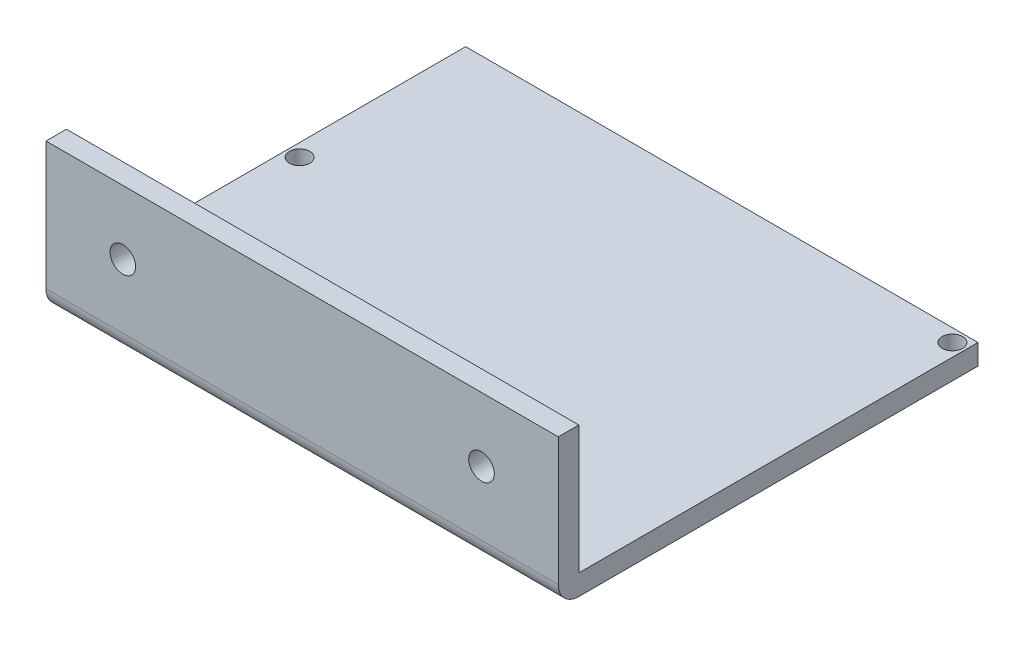
ISO-10303-21;
HEADER;
FILE_DESCRIPTION(('STEP AP214'),'2;1');
FILE_NAME('part.step','',(''),(''),'','','');
FILE_SCHEMA(('AUTOMOTIVE_DESIGN { 1 0 10303 214 1 1 1 1 }'));
ENDSEC;
DATA;
#1=APPLICATION_CONTEXT('core data for automotive mechanical design processes');
#2=APPLICATION_PROTOCOL_DEFINITION('international standard','automotive_design',2000,#1);
#3=PRODUCT_CONTEXT('',#1,'mechanical');
#4=PRODUCT('Part','Part','',(#3));
#5=PRODUCT_RELATED_PRODUCT_CATEGORY('part','',(#4));
#6=PRODUCT_DEFINITION_FORMATION('','',#4);
#7=PRODUCT_DEFINITION_CONTEXT('part definition',#1,'design');
#8=PRODUCT_DEFINITION('design','',#6,#7);
#9=PRODUCT_DEFINITION_SHAPE('','',#8);
#10=(LENGTH_UNIT() NAMED_UNIT(*) SI_UNIT(.MILLI.,.METRE.));
#11=(NAMED_UNIT(*) PLANE_ANGLE_UNIT() SI_UNIT($,.RADIAN.));
#12=(NAMED_UNIT(*) SI_UNIT($,.STERADIAN.) SOLID_ANGLE_UNIT());
#13=UNCERTAINTY_MEASURE_WITH_UNIT(LENGTH_MEASURE(1.E-05),#10,'distance_accuracy_value','');
#14=(GEOMETRIC_REPRESENTATION_CONTEXT(3) GLOBAL_UNCERTAINTY_ASSIGNED_CONTEXT((#13)) GLOBAL_UNIT_ASSIGNED_CONTEXT((#10,
#11,#12)) REPRESENTATION_CONTEXT('',''));
#15=CARTESIAN_POINT('',(0.,0.,0.));
#16=DIRECTION('',(0.,0.,1.));
#17=DIRECTION('',(1.,0.,0.));
#18=AXIS2_PLACEMENT_3D('',#15,#16,#17);
#19=CARTESIAN_POINT('',(100.,4.,0.));
#20=DIRECTION('',(1.,0.,0.));
#21=DIRECTION('',(0.,0.,-1.));
#22=AXIS2_PLACEMENT_3D('',#19,#20,#21);
#23=PLANE('',#22);
#24=DIRECTION('',(0.,0.,1.));
#25=VECTOR('',#24,1.);
#26=CARTESIAN_POINT('',(100.,0.,0.));
#27=LINE('',#26,#25);
#28=CARTESIAN_POINT('',(100.,0.,-72.9078086307585));
#29=VERTEX_POINT('',#28);
#30=CARTESIAN_POINT('',(100.,0.,5.));
#31=VERTEX_POINT('',#30);
#32=EDGE_CURVE('E474',#29,#31,#27,.T.);
#33=ORIENTED_EDGE('',*,*,#32,.F.);
#34=DIRECTION('',(0.,-1.,0.));
#35=VECTOR('',#34,1.);
#36=CARTESIAN_POINT('',(100.,4.,-72.9078086307585));
#37=LINE('',#36,#35);
#38=CARTESIAN_POINT('',(100.,4.,-72.9078086307585));
#39=VERTEX_POINT('',#38);
#40=EDGE_CURVE('E11',#39,#29,#37,.T.);
#41=ORIENTED_EDGE('',*,*,#40,.F.);
#42=DIRECTION('',(0.,0.,1.));
#43=VECTOR('',#42,1.);
#44=CARTESIAN_POINT('',(100.,4.,0.));
#45=LINE('',#44,#43);
#46=CARTESIAN_POINT('',(100.,4.,5.));
#47=VERTEX_POINT('',#46);
#48=EDGE_CURVE('E455',#39,#47,#45,.T.);
#49=ORIENTED_EDGE('',*,*,#48,.T.);
#50=DIRECTION('',(0.,-1.,0.));
#51=VECTOR('',#50,1.);
#52=CARTESIAN_POINT('',(100.,4.,5.));
#53=LINE('',#52,#51);
#54=CARTESIAN_POINT('',(100.,29.,5.));
#55=VERTEX_POINT('',#54);
#56=EDGE_CURVE('E418',#55,#47,#53,.T.);
#57=ORIENTED_EDGE('',*,*,#56,.F.);
#58=DIRECTION('',(0.,0.,-1.));
#59=VECTOR('',#58,1.);
#60=CARTESIAN_POINT('',(100.,29.,5.00000000000001));
#61=LINE('',#60,#59);
#62=CARTESIAN_POINT('',(100.,29.,9.));
#63=VERTEX_POINT('',#62);
#64=EDGE_CURVE('E423',#63,#55,#61,.T.);
#65=ORIENTED_EDGE('',*,*,#64,.F.);
#66=DIRECTION('',(0.,1.,0.));
#67=VECTOR('',#66,1.);
#68=CARTESIAN_POINT('',(100.,29.,9.));
#69=LINE('',#68,#67);
#70=CARTESIAN_POINT('',(100.,4.,9.00000000000001));
#71=VERTEX_POINT('',#70);
#72=EDGE_CURVE('E427',#71,#63,#69,.T.);
#73=ORIENTED_EDGE('',*,*,#72,.F.);
#74=CARTESIAN_POINT('',(100.,4.,5.));
#75=DIRECTION('',(1.,0.,0.));
#76=DIRECTION('',(0.,0.,-1.));
#77=AXIS2_PLACEMENT_3D('',#74,#75,#76);
#78=CIRCLE('',#77,4.);
#79=EDGE_CURVE('E431',#31,#71,#78,.F.);
#80=ORIENTED_EDGE('',*,*,#79,.F.);
#81=EDGE_LOOP('',(#33,#41,#49,#57,#65,#73,#80));
#82=FACE_BOUND('',#81,.T.);
#83=ADVANCED_FACE('F37',(#82),#23,.T.);
#84=CARTESIAN_POINT('',(0.,4.,-72.9078086307585));
#85=DIRECTION('',(0.,0.,-1.));
#86=DIRECTION('',(-1.,0.,0.));
#87=AXIS2_PLACEMENT_3D('',#84,#85,#86);
#88=PLANE('',#87);
#89=DIRECTION('',(1.,0.,0.));
#90=VECTOR('',#89,1.);
#91=CARTESIAN_POINT('',(0.,0.,-72.9078086307585));
#92=LINE('',#91,#90);
#93=CARTESIAN_POINT('',(0.,0.,-72.9078086307585));
#94=VERTEX_POINT('',#93);
#95=EDGE_CURVE('E476',#94,#29,#92,.T.);
#96=ORIENTED_EDGE('',*,*,#95,.F.);
#97=DIRECTION('',(0.,-1.,0.));
#98=VECTOR('',#97,1.);
#99=CARTESIAN_POINT('',(0.,4.,-72.9078086307585));
#100=LINE('',#99,#98);
#101=CARTESIAN_POINT('',(0.,4.,-72.9078086307585));
#102=VERTEX_POINT('',#101);
#103=EDGE_CURVE('E45',#102,#94,#100,.T.);
#104=ORIENTED_EDGE('',*,*,#103,.F.);
#105=DIRECTION('',(1.,0.,0.));
#106=VECTOR('',#105,1.);
#107=CARTESIAN_POINT('',(0.,4.,-72.9078086307585));
#108=LINE('',#107,#106);
#109=EDGE_CURVE('E457',#102,#39,#108,.T.);
#110=ORIENTED_EDGE('',*,*,#109,.T.);
#111=ORIENTED_EDGE('',*,*,#40,.T.);
#112=EDGE_LOOP('',(#96,#104,#110,#111));
#113=FACE_BOUND('',#112,.T.);
#114=ADVANCED_FACE('F485',(#113),#88,.T.);
#115=CARTESIAN_POINT('',(20.,4.,-3.49999999999999));
#116=DIRECTION('',(0.,-1.,0.));
#117=DIRECTION('',(0.,0.,-1.));
#118=AXIS2_PLACEMENT_3D('',#115,#116,#117);
#119=CYLINDRICAL_SURFACE('',#118,2.0830802465931);
#120=CARTESIAN_POINT('',(20.,4.,-3.49999999999999));
#121=DIRECTION('',(0.,1.,0.));
#122=DIRECTION('',(0.,0.,1.));
#123=AXIS2_PLACEMENT_3D('',#120,#121,#122);
#124=CIRCLE('',#123,2.0830802465931);
#125=CARTESIAN_POINT('',(20.,4.,-1.41691975340689));
#126=VERTEX_POINT('',#125);
#127=EDGE_CURVE('E452',#126,#126,#124,.T.);
#128=ORIENTED_EDGE('',*,*,#127,.T.);
#129=EDGE_LOOP('',(#128));
#130=FACE_BOUND('',#129,.T.);
#131=CARTESIAN_POINT('',(20.,0.,-3.49999999999999));
#132=DIRECTION('',(0.,1.,0.));
#133=DIRECTION('',(0.,0.,1.));
#134=AXIS2_PLACEMENT_3D('',#131,#132,#133);
#135=CIRCLE('',#134,2.0830802465931);
#136=CARTESIAN_POINT('',(20.,0.,-1.41691975340689));
#137=VERTEX_POINT('',#136);
#138=EDGE_CURVE('E471',#137,#137,#135,.T.);
#139=ORIENTED_EDGE('',*,*,#138,.F.);
#140=EDGE_LOOP('',(#139));
#141=FACE_BOUND('',#140,.T.);
#142=ADVANCED_FACE('F516',(#130,#141),#119,.F.);
#143=CARTESIAN_POINT('',(82.5,4.,-3.5));
#144=DIRECTION('',(0.,-1.,0.));
#145=DIRECTION('',(0.,0.,-1.));
#146=AXIS2_PLACEMENT_3D('',#143,#144,#145);
#147=CYLINDRICAL_SURFACE('',#146,2.);
#148=CARTESIAN_POINT('',(82.5,4.,-3.5));
#149=DIRECTION('',(0.,1.,0.));
#150=DIRECTION('',(0.,0.,1.));
#151=AXIS2_PLACEMENT_3D('',#148,#149,#150);
#152=CIRCLE('',#151,2.);
#153=CARTESIAN_POINT('',(82.5,4.,-1.5));
#154=VERTEX_POINT('',#153);
#155=EDGE_CURVE('E449',#154,#154,#152,.T.);
#156=ORIENTED_EDGE('',*,*,#155,.T.);
#157=EDGE_LOOP('',(#156));
#158=FACE_BOUND('',#157,.T.);
#159=CARTESIAN_POINT('',(82.5,0.,-3.5));
#160=DIRECTION('',(0.,1.,0.));
#161=DIRECTION('',(0.,0.,1.));
#162=AXIS2_PLACEMENT_3D('',#159,#160,#161);
#163=CIRCLE('',#162,2.);
#164=CARTESIAN_POINT('',(82.5,0.,-1.5));
#165=VERTEX_POINT('',#164);
#166=EDGE_CURVE('E468',#165,#165,#163,.T.);
#167=ORIENTED_EDGE('',*,*,#166,.F.);
#168=EDGE_LOOP('',(#167));
#169=FACE_BOUND('',#168,.T.);
#170=ADVANCED_FACE('F522',(#158,#169),#147,.F.);
#171=CARTESIAN_POINT('',(2.5,4.,-38.));
#172=DIRECTION('',(0.,-1.,0.));
#173=DIRECTION('',(0.,0.,-1.));
#174=AXIS2_PLACEMENT_3D('',#171,#172,#173);
#175=CYLINDRICAL_SURFACE('',#174,2.);
#176=CARTESIAN_POINT('',(2.5,4.,-38.));
#177=DIRECTION('',(0.,1.,0.));
#178=DIRECTION('',(0.,0.,1.));
#179=AXIS2_PLACEMENT_3D('',#176,#177,#178);
#180=CIRCLE('',#179,2.);
#181=CARTESIAN_POINT('',(2.5,4.,-36.));
#182=VERTEX_POINT('',#181);
#183=EDGE_CURVE('E445',#182,#182,#180,.T.);
#184=ORIENTED_EDGE('',*,*,#183,.T.);
#185=EDGE_LOOP('',(#184));
#186=FACE_BOUND('',#185,.T.);
#187=CARTESIAN_POINT('',(2.5,0.,-38.));
#188=DIRECTION('',(0.,1.,0.));
#189=DIRECTION('',(0.,0.,1.));
#190=AXIS2_PLACEMENT_3D('',#187,#188,#189);
#191=CIRCLE('',#190,2.);
#192=CARTESIAN_POINT('',(2.5,0.,-36.));
#193=VERTEX_POINT('',#192);
#194=EDGE_CURVE('E465',#193,#193,#191,.T.);
#195=ORIENTED_EDGE('',*,*,#194,.F.);
#196=EDGE_LOOP('',(#195));
#197=FACE_BOUND('',#196,.T.);
#198=ADVANCED_FACE('F525',(#186,#197),#175,.F.);
#199=CARTESIAN_POINT('',(97.5,4.,-70.4078086307585));
#200=DIRECTION('',(0.,-1.,0.));
#201=DIRECTION('',(0.,0.,-1.));
#202=AXIS2_PLACEMENT_3D('',#199,#200,#201);
#203=CYLINDRICAL_SURFACE('',#202,2.);
#204=CARTESIAN_POINT('',(97.5,4.,-70.4078086307585));
#205=DIRECTION('',(0.,1.,0.));
#206=DIRECTION('',(0.,0.,1.));
#207=AXIS2_PLACEMENT_3D('',#204,#205,#206);
#208=CIRCLE('',#207,2.);
#209=CARTESIAN_POINT('',(97.5,4.,-68.4078086307585));
#210=VERTEX_POINT('',#209);
#211=EDGE_CURVE('E442',#210,#210,#208,.T.);
#212=ORIENTED_EDGE('',*,*,#211,.T.);
#213=EDGE_LOOP('',(#212));
#214=FACE_BOUND('',#213,.T.);
#215=CARTESIAN_POINT('',(97.5,0.,-70.4078086307585));
#216=DIRECTION('',(0.,1.,0.));
#217=DIRECTION('',(0.,0.,1.));
#218=AXIS2_PLACEMENT_3D('',#215,#216,#217);
#219=CIRCLE('',#218,2.);
#220=CARTESIAN_POINT('',(97.5,0.,-68.4078086307585));
#221=VERTEX_POINT('',#220);
#222=EDGE_CURVE('E436',#221,#221,#219,.T.);
#223=ORIENTED_EDGE('',*,*,#222,.F.);
#224=EDGE_LOOP('',(#223));
#225=FACE_BOUND('',#224,.T.);
#226=ADVANCED_FACE('F39',(#214,#225),#203,.F.);
#227=CARTESIAN_POINT('',(0.,4.,0.));
#228=DIRECTION('',(-1.,0.,0.));
#229=DIRECTION('',(0.,0.,1.));
#230=AXIS2_PLACEMENT_3D('',#227,#228,#229);
#231=PLANE('',#230);
#232=DIRECTION('',(0.,0.,-1.));
#233=VECTOR('',#232,1.);
#234=CARTESIAN_POINT('',(0.,0.,0.));
#235=LINE('',#234,#233);
#236=CARTESIAN_POINT('',(0.,0.,5.));
#237=VERTEX_POINT('',#236);
#238=EDGE_CURVE('E446',#237,#94,#235,.T.);
#239=ORIENTED_EDGE('',*,*,#238,.F.);
#240=CARTESIAN_POINT('',(0.,4.,5.));
#241=DIRECTION('',(-1.,0.,0.));
#242=DIRECTION('',(0.,0.,-1.));
#243=AXIS2_PLACEMENT_3D('',#240,#241,#242);
#244=CIRCLE('',#243,4.);
#245=CARTESIAN_POINT('',(0.,4.,9.00000000000001));
#246=VERTEX_POINT('',#245);
#247=EDGE_CURVE('E397',#237,#246,#244,.T.);
#248=ORIENTED_EDGE('',*,*,#247,.T.);
#249=DIRECTION('',(0.,1.,0.));
#250=VECTOR('',#249,1.);
#251=CARTESIAN_POINT('',(0.,29.,9.));
#252=LINE('',#251,#250);
#253=CARTESIAN_POINT('',(0.,29.,9.));
#254=VERTEX_POINT('',#253);
#255=EDGE_CURVE('E413',#246,#254,#252,.T.);
#256=ORIENTED_EDGE('',*,*,#255,.T.);
#257=DIRECTION('',(0.,0.,-1.));
#258=VECTOR('',#257,1.);
#259=CARTESIAN_POINT('',(0.,29.,5.));
#260=LINE('',#259,#258);
#261=CARTESIAN_POINT('',(0.,29.,5.));
#262=VERTEX_POINT('',#261);
#263=EDGE_CURVE('E410',#254,#262,#260,.T.);
#264=ORIENTED_EDGE('',*,*,#263,.T.);
#265=DIRECTION('',(0.,-1.,0.));
#266=VECTOR('',#265,1.);
#267=CARTESIAN_POINT('',(0.,4.,5.));
#268=LINE('',#267,#266);
#269=CARTESIAN_POINT('',(0.,4.,5.));
#270=VERTEX_POINT('',#269);
#271=EDGE_CURVE('E406',#262,#270,#268,.T.);
#272=ORIENTED_EDGE('',*,*,#271,.T.);
#273=DIRECTION('',(0.,0.,-1.));
#274=VECTOR('',#273,1.);
#275=CARTESIAN_POINT('',(0.,4.,0.));
#276=LINE('',#275,#274);
#277=EDGE_CURVE('E460',#270,#102,#276,.T.);
#278=ORIENTED_EDGE('',*,*,#277,.T.);
#279=ORIENTED_EDGE('',*,*,#103,.T.);
#280=EDGE_LOOP('',(#239,#248,#256,#264,#272,#278,#279));
#281=FACE_BOUND('',#280,.T.);
#282=ADVANCED_FACE('F482',(#281),#231,.T.);
#283=CARTESIAN_POINT('',(0.,4.,0.));
#284=DIRECTION('',(0.,1.,0.));
#285=DIRECTION('',(0.,0.,1.));
#286=AXIS2_PLACEMENT_3D('',#283,#284,#285);
#287=PLANE('',#286);
#288=ORIENTED_EDGE('',*,*,#211,.F.);
#289=EDGE_LOOP('',(#288));
#290=FACE_BOUND('',#289,.T.);
#291=ORIENTED_EDGE('',*,*,#183,.F.);
#292=EDGE_LOOP('',(#291));
#293=FACE_BOUND('',#292,.T.);
#294=ORIENTED_EDGE('',*,*,#155,.F.);
#295=EDGE_LOOP('',(#294));
#296=FACE_BOUND('',#295,.T.);
#297=ORIENTED_EDGE('',*,*,#127,.F.);
#298=EDGE_LOOP('',(#297));
#299=FACE_BOUND('',#298,.T.);
#300=ORIENTED_EDGE('',*,*,#277,.F.);
#301=DIRECTION('',(-1.,0.,0.));
#302=VECTOR('',#301,1.);
#303=CARTESIAN_POINT('',(130.364452901378,4.,5.));
#304=LINE('',#303,#302);
#305=EDGE_CURVE('E421',#47,#270,#304,.T.);
#306=ORIENTED_EDGE('',*,*,#305,.F.);
#307=ORIENTED_EDGE('',*,*,#48,.F.);
#308=ORIENTED_EDGE('',*,*,#109,.F.);
#309=EDGE_LOOP('',(#300,#306,#307,#308));
#310=FACE_BOUND('',#309,.T.);
#311=ADVANCED_FACE('F509',(#290,#293,#296,#299,#310),#287,.T.);
#312=CARTESIAN_POINT('',(0.,0.,0.));
#313=DIRECTION('',(0.,1.,0.));
#314=DIRECTION('',(0.,0.,1.));
#315=AXIS2_PLACEMENT_3D('',#312,#313,#314);
#316=PLANE('',#315);
#317=DIRECTION('',(0.,0.,1.));
#318=VECTOR('',#317,1.);
#319=CARTESIAN_POINT('',(97.8928279472022,0.,-63.6310799164491));
#320=LINE('',#319,#318);
#321=CARTESIAN_POINT('',(97.8928279472022,0.,-63.6310799164491));
#322=VERTEX_POINT('',#321);
#323=CARTESIAN_POINT('',(97.8928279472022,0.,-36.4151652990593));
#324=VERTEX_POINT('',#323);
#325=EDGE_CURVE('E277',#322,#324,#320,.T.);
#326=ORIENTED_EDGE('',*,*,#325,.F.);
#327=DIRECTION('',(0.674066970811212,0.,0.73867023688612));
#328=VECTOR('',#327,1.);
#329=CARTESIAN_POINT('',(91.252513721809,0.,-70.9078086307585));
#330=LINE('',#329,#328);
#331=CARTESIAN_POINT('',(91.252513721809,0.,-70.9078086307585));
#332=VERTEX_POINT('',#331);
#333=EDGE_CURVE('E52',#332,#322,#330,.T.);
#334=ORIENTED_EDGE('',*,*,#333,.F.);
#335=DIRECTION('',(1.,0.,0.));
#336=VECTOR('',#335,1.);
#337=CARTESIAN_POINT('',(91.252513721809,0.,-70.9078086307585));
#338=LINE('',#337,#336);
#339=CARTESIAN_POINT('',(3.43298061088859,0.,-70.9078086307585));
#340=VERTEX_POINT('',#339);
#341=EDGE_CURVE('E242',#340,#332,#338,.T.);
#342=ORIENTED_EDGE('',*,*,#341,.F.);
#343=DIRECTION('',(0.,0.,-1.));
#344=VECTOR('',#343,1.);
#345=CARTESIAN_POINT('',(3.43298061088859,0.,-70.9078086307585));
#346=LINE('',#345,#344);
#347=CARTESIAN_POINT('',(3.43298061088859,0.,-44.280868197459));
#348=VERTEX_POINT('',#347);
#349=EDGE_CURVE('E245',#348,#340,#346,.T.);
#350=ORIENTED_EDGE('',*,*,#349,.F.);
#351=DIRECTION('',(-1.,0.,0.));
#352=VECTOR('',#351,1.);
#353=CARTESIAN_POINT('',(12.6476428594877,0.,-44.280868197459));
#354=LINE('',#353,#352);
#355=CARTESIAN_POINT('',(12.6476428594877,0.,-44.280868197459));
#356=VERTEX_POINT('',#355);
#357=EDGE_CURVE('E304',#356,#348,#354,.T.);
#358=ORIENTED_EDGE('',*,*,#357,.F.);
#359=DIRECTION('',(0.,0.,1.));
#360=VECTOR('',#359,1.);
#361=CARTESIAN_POINT('',(12.6476428594877,0.,-63.6310799164491));
#362=LINE('',#361,#360);
#363=CARTESIAN_POINT('',(12.6476428594877,0.,-63.6310799164491));
#364=VERTEX_POINT('',#363);
#365=EDGE_CURVE('E301',#364,#356,#362,.T.);
#366=ORIENTED_EDGE('',*,*,#365,.F.);
#367=DIRECTION('',(-1.,0.,0.));
#368=VECTOR('',#367,1.);
#369=CARTESIAN_POINT('',(51.9500782906483,0.,-63.6310799164491));
#370=LINE('',#369,#368);
#371=CARTESIAN_POINT('',(51.9500782906483,0.,-63.6310799164491));
#372=VERTEX_POINT('',#371);
#373=EDGE_CURVE('E298',#372,#364,#370,.T.);
#374=ORIENTED_EDGE('',*,*,#373,.F.);
#375=DIRECTION('',(0.,0.,-1.));
#376=VECTOR('',#375,1.);
#377=CARTESIAN_POINT('',(51.9500782906483,0.,-63.6310799164491));
#378=LINE('',#377,#376);
#379=CARTESIAN_POINT('',(51.9500782906483,0.,-54.7474775195852));
#380=VERTEX_POINT('',#379);
#381=EDGE_CURVE('E295',#380,#372,#378,.T.);
#382=ORIENTED_EDGE('',*,*,#381,.F.);
#383=DIRECTION('',(-1.,0.,0.));
#384=VECTOR('',#383,1.);
#385=CARTESIAN_POINT('',(61.9788193724453,0.,-54.7474775195852));
#386=LINE('',#385,#384);
#387=CARTESIAN_POINT('',(61.9788193724453,0.,-54.7474775195852));
#388=VERTEX_POINT('',#387);
#389=EDGE_CURVE('E292',#388,#380,#386,.T.);
#390=ORIENTED_EDGE('',*,*,#389,.F.);
#391=DIRECTION('',(0.,0.,1.));
#392=VECTOR('',#391,1.);
#393=CARTESIAN_POINT('',(61.9788193724453,0.,-63.6310799164491));
#394=LINE('',#393,#392);
#395=CARTESIAN_POINT('',(61.9788193724453,0.,-63.6310799164491));
#396=VERTEX_POINT('',#395);
#397=EDGE_CURVE('E289',#396,#388,#394,.T.);
#398=ORIENTED_EDGE('',*,*,#397,.F.);
#399=DIRECTION('',(-1.,0.,0.));
#400=VECTOR('',#399,1.);
#401=CARTESIAN_POINT('',(91.252513721809,0.,-63.6310799164491));
#402=LINE('',#401,#400);
#403=CARTESIAN_POINT('',(91.252513721809,0.,-63.6310799164491));
#404=VERTEX_POINT('',#403);
#405=EDGE_CURVE('E286',#404,#396,#402,.T.);
#406=ORIENTED_EDGE('',*,*,#405,.F.);
#407=DIRECTION('',(0.,0.,-1.));
#408=VECTOR('',#407,1.);
#409=CARTESIAN_POINT('',(91.252513721809,0.,-63.6310799164491));
#410=LINE('',#409,#408);
#411=CARTESIAN_POINT('',(91.252513721809,0.,-36.4151652990593));
#412=VERTEX_POINT('',#411);
#413=EDGE_CURVE('E283',#412,#404,#410,.T.);
#414=ORIENTED_EDGE('',*,*,#413,.F.);
#415=DIRECTION('',(-1.,0.,0.));
#416=VECTOR('',#415,1.);
#417=CARTESIAN_POINT('',(91.252513721809,0.,-36.4151652990593));
#418=LINE('',#417,#416);
#419=EDGE_CURVE('E280',#324,#412,#418,.T.);
#420=ORIENTED_EDGE('',*,*,#419,.F.);
#421=EDGE_LOOP('',(#326,#334,#342,#350,#358,#366,#374,#382,#390,#398,#406,#414,#420));
#422=FACE_BOUND('',#421,.T.);
#423=DIRECTION('',(-1.,0.,0.));
#424=VECTOR('',#423,1.);
#425=CARTESIAN_POINT('',(78.4581876947499,0.,-1.4214969099271));
#426=LINE('',#425,#424);
#427=CARTESIAN_POINT('',(78.4581876947499,0.,-1.4214969099271));
#428=VERTEX_POINT('',#427);
#429=CARTESIAN_POINT('',(24.4257004078356,0.,-1.4214969099271));
#430=VERTEX_POINT('',#429);
#431=EDGE_CURVE('E348',#428,#430,#426,.T.);
#432=ORIENTED_EDGE('',*,*,#431,.F.);
#433=DIRECTION('',(0.,0.,1.));
#434=VECTOR('',#433,1.);
#435=CARTESIAN_POINT('',(78.4581876947499,0.,-5.65979680150974));
#436=LINE('',#435,#434);
#437=CARTESIAN_POINT('',(78.4581876947499,0.,-5.65979680150974));
#438=VERTEX_POINT('',#437);
#439=EDGE_CURVE('E60',#438,#428,#436,.T.);
#440=ORIENTED_EDGE('',*,*,#439,.F.);
#441=DIRECTION('',(1.,0.,0.));
#442=VECTOR('',#441,1.);
#443=CARTESIAN_POINT('',(78.4581876947499,0.,-5.65979680150974));
#444=LINE('',#443,#442);
#445=CARTESIAN_POINT('',(24.4257004078356,0.,-5.65979680150974));
#446=VERTEX_POINT('',#445);
#447=EDGE_CURVE('E337',#446,#438,#444,.T.);
#448=ORIENTED_EDGE('',*,*,#447,.F.);
#449=DIRECTION('',(0.,0.,-1.));
#450=VECTOR('',#449,1.);
#451=CARTESIAN_POINT('',(24.4257004078356,0.,-5.65979680150974));
#452=LINE('',#451,#450);
#453=EDGE_CURVE('E352',#430,#446,#452,.T.);
#454=ORIENTED_EDGE('',*,*,#453,.F.);
#455=EDGE_LOOP('',(#432,#440,#448,#454));
#456=FACE_BOUND('',#455,.T.);
#457=DIRECTION('',(-1.,0.,0.));
#458=VECTOR('',#457,1.);
#459=CARTESIAN_POINT('',(16.3357743673984,0.,-1.4214969099271));
#460=LINE('',#459,#458);
#461=CARTESIAN_POINT('',(16.3357743673984,0.,-1.4214969099271));
#462=VERTEX_POINT('',#461);
#463=CARTESIAN_POINT('',(3.43298061088859,0.,-1.4214969099271));
#464=VERTEX_POINT('',#463);
#465=EDGE_CURVE('E379',#462,#464,#460,.T.);
#466=ORIENTED_EDGE('',*,*,#465,.F.);
#467=DIRECTION('',(0.,0.,1.));
#468=VECTOR('',#467,1.);
#469=CARTESIAN_POINT('',(16.3357743673984,0.,-5.65979680150974));
#470=LINE('',#469,#468);
#471=CARTESIAN_POINT('',(16.3357743673984,0.,-5.65979680150974));
#472=VERTEX_POINT('',#471);
#473=EDGE_CURVE('E377',#472,#462,#470,.T.);
#474=ORIENTED_EDGE('',*,*,#473,.F.);
#475=DIRECTION('',(1.,0.,0.));
#476=VECTOR('',#475,1.);
#477=CARTESIAN_POINT('',(16.3357743673984,0.,-5.65979680150974));
#478=LINE('',#477,#476);
#479=CARTESIAN_POINT('',(3.43298061088859,0.,-5.65979680150974));
#480=VERTEX_POINT('',#479);
#481=EDGE_CURVE('E367',#480,#472,#478,.T.);
#482=ORIENTED_EDGE('',*,*,#481,.F.);
#483=DIRECTION('',(0.,0.,-1.));
#484=VECTOR('',#483,1.);
#485=CARTESIAN_POINT('',(3.43298061088859,0.,-5.65979680150974));
#486=LINE('',#485,#484);
#487=EDGE_CURVE('E382',#464,#480,#486,.T.);
#488=ORIENTED_EDGE('',*,*,#487,.F.);
#489=EDGE_LOOP('',(#466,#474,#482,#488));
#490=FACE_BOUND('',#489,.T.);
#491=ORIENTED_EDGE('',*,*,#222,.T.);
#492=EDGE_LOOP('',(#491));
#493=FACE_BOUND('',#492,.T.);
#494=ORIENTED_EDGE('',*,*,#194,.T.);
#495=EDGE_LOOP('',(#494));
#496=FACE_BOUND('',#495,.T.);
#497=ORIENTED_EDGE('',*,*,#166,.T.);
#498=EDGE_LOOP('',(#497));
#499=FACE_BOUND('',#498,.T.);
#500=ORIENTED_EDGE('',*,*,#138,.T.);
#501=EDGE_LOOP('',(#500));
#502=FACE_BOUND('',#501,.T.);
#503=ORIENTED_EDGE('',*,*,#32,.T.);
#504=DIRECTION('',(-1.,0.,0.));
#505=VECTOR('',#504,1.);
#506=CARTESIAN_POINT('',(130.364452901378,0.,5.));
#507=LINE('',#506,#505);
#508=EDGE_CURVE('E409',#31,#237,#507,.T.);
#509=ORIENTED_EDGE('',*,*,#508,.T.);
#510=ORIENTED_EDGE('',*,*,#238,.T.);
#511=ORIENTED_EDGE('',*,*,#95,.T.);
#512=EDGE_LOOP('',(#503,#509,#510,#511));
#513=FACE_BOUND('',#512,.T.);
#514=ADVANCED_FACE('F488',(#422,#456,#490,#493,#496,#499,#502,#513),#316,.F.);
#515=CARTESIAN_POINT('',(130.364452901378,4.,5.));
#516=DIRECTION('',(-1.,0.,0.));
#517=DIRECTION('',(0.,0.,1.));
#518=AXIS2_PLACEMENT_3D('',#515,#516,#517);
#519=CYLINDRICAL_SURFACE('',#518,4.);
#520=ORIENTED_EDGE('',*,*,#508,.F.);
#521=ORIENTED_EDGE('',*,*,#79,.T.);
#522=DIRECTION('',(-1.,0.,0.));
#523=VECTOR('',#522,1.);
#524=CARTESIAN_POINT('',(130.364452901378,4.,9.00000000000001));
#525=LINE('',#524,#523);
#526=EDGE_CURVE('E430',#71,#246,#525,.T.);
#527=ORIENTED_EDGE('',*,*,#526,.T.);
#528=ORIENTED_EDGE('',*,*,#247,.F.);
#529=EDGE_LOOP('',(#520,#521,#527,#528));
#530=FACE_BOUND('',#529,.T.);
#531=ADVANCED_FACE('F493',(#530),#519,.T.);
#532=CARTESIAN_POINT('',(130.364452901378,29.,9.));
#533=DIRECTION('',(0.,0.,1.));
#534=DIRECTION('',(0.,-1.,0.));
#535=AXIS2_PLACEMENT_3D('',#532,#533,#534);
#536=PLANE('',#535);
#537=CARTESIAN_POINT('',(15.,16.5,9.00000000000001));
#538=DIRECTION('',(0.,0.,1.));
#539=DIRECTION('',(1.,0.,0.));
#540=AXIS2_PLACEMENT_3D('',#537,#538,#539);
#541=CIRCLE('',#540,2.5);
#542=CARTESIAN_POINT('',(17.5,16.5,9.00000000000001));
#543=VERTEX_POINT('',#542);
#544=EDGE_CURVE('E398',#543,#543,#541,.T.);
#545=ORIENTED_EDGE('',*,*,#544,.F.);
#546=EDGE_LOOP('',(#545));
#547=FACE_BOUND('',#546,.T.);
#548=CARTESIAN_POINT('',(85.,16.5,9.00000000000001));
#549=DIRECTION('',(0.,0.,1.));
#550=DIRECTION('',(1.,0.,0.));
#551=AXIS2_PLACEMENT_3D('',#548,#549,#550);
#552=CIRCLE('',#551,2.50000000000001);
#553=CARTESIAN_POINT('',(87.5,16.5,9.00000000000001));
#554=VERTEX_POINT('',#553);
#555=EDGE_CURVE('E311',#554,#554,#552,.T.);
#556=ORIENTED_EDGE('',*,*,#555,.F.);
#557=EDGE_LOOP('',(#556));
#558=FACE_BOUND('',#557,.T.);
#559=ORIENTED_EDGE('',*,*,#526,.F.);
#560=ORIENTED_EDGE('',*,*,#72,.T.);
#561=DIRECTION('',(-1.,0.,0.));
#562=VECTOR('',#561,1.);
#563=CARTESIAN_POINT('',(130.364452901378,29.,9.));
#564=LINE('',#563,#562);
#565=EDGE_CURVE('E426',#63,#254,#564,.T.);
#566=ORIENTED_EDGE('',*,*,#565,.T.);
#567=ORIENTED_EDGE('',*,*,#255,.F.);
#568=EDGE_LOOP('',(#559,#560,#566,#567));
#569=FACE_BOUND('',#568,.T.);
#570=ADVANCED_FACE('F498',(#547,#558,#569),#536,.T.);
#571=CARTESIAN_POINT('',(130.364452901378,29.,5.));
#572=DIRECTION('',(0.,1.,0.));
#573=DIRECTION('',(0.,0.,1.));
#574=AXIS2_PLACEMENT_3D('',#571,#572,#573);
#575=PLANE('',#574);
#576=ORIENTED_EDGE('',*,*,#565,.F.);
#577=ORIENTED_EDGE('',*,*,#64,.T.);
#578=DIRECTION('',(-1.,0.,0.));
#579=VECTOR('',#578,1.);
#580=CARTESIAN_POINT('',(130.364452901378,29.,5.));
#581=LINE('',#580,#579);
#582=EDGE_CURVE('E422',#55,#262,#581,.T.);
#583=ORIENTED_EDGE('',*,*,#582,.T.);
#584=ORIENTED_EDGE('',*,*,#263,.F.);
#585=EDGE_LOOP('',(#576,#577,#583,#584));
#586=FACE_BOUND('',#585,.T.);
#587=ADVANCED_FACE('F501',(#586),#575,.T.);
#588=CARTESIAN_POINT('',(130.364452901378,4.,5.));
#589=DIRECTION('',(0.,0.,-1.));
#590=DIRECTION('',(-1.,0.,0.));
#591=AXIS2_PLACEMENT_3D('',#588,#589,#590);
#592=PLANE('',#591);
#593=CARTESIAN_POINT('',(15.,16.5,5.));
#594=DIRECTION('',(0.,0.,1.));
#595=DIRECTION('',(1.,0.,0.));
#596=AXIS2_PLACEMENT_3D('',#593,#594,#595);
#597=CIRCLE('',#596,2.5);
#598=CARTESIAN_POINT('',(17.5,16.5,5.));
#599=VERTEX_POINT('',#598);
#600=EDGE_CURVE('E394',#599,#599,#597,.T.);
#601=ORIENTED_EDGE('',*,*,#600,.T.);
#602=EDGE_LOOP('',(#601));
#603=FACE_BOUND('',#602,.T.);
#604=CARTESIAN_POINT('',(85.,16.5,5.));
#605=DIRECTION('',(0.,0.,1.));
#606=DIRECTION('',(1.,0.,0.));
#607=AXIS2_PLACEMENT_3D('',#604,#605,#606);
#608=CIRCLE('',#607,2.50000000000001);
#609=CARTESIAN_POINT('',(87.5,16.5,5.));
#610=VERTEX_POINT('',#609);
#611=EDGE_CURVE('E401',#610,#610,#608,.T.);
#612=ORIENTED_EDGE('',*,*,#611,.T.);
#613=EDGE_LOOP('',(#612));
#614=FACE_BOUND('',#613,.T.);
#615=ORIENTED_EDGE('',*,*,#582,.F.);
#616=ORIENTED_EDGE('',*,*,#56,.T.);
#617=ORIENTED_EDGE('',*,*,#305,.T.);
#618=ORIENTED_EDGE('',*,*,#271,.F.);
#619=EDGE_LOOP('',(#615,#616,#617,#618));
#620=FACE_BOUND('',#619,.T.);
#621=ADVANCED_FACE('F505',(#603,#614,#620),#592,.T.);
#622=CARTESIAN_POINT('',(85.,16.5,5.));
#623=DIRECTION('',(0.,0.,1.));
#624=DIRECTION('',(1.,0.,0.));
#625=AXIS2_PLACEMENT_3D('',#622,#623,#624);
#626=CYLINDRICAL_SURFACE('',#625,2.50000000000001);
#627=ORIENTED_EDGE('',*,*,#611,.F.);
#628=EDGE_LOOP('',(#627));
#629=FACE_BOUND('',#628,.T.);
#630=ORIENTED_EDGE('',*,*,#555,.T.);
#631=EDGE_LOOP('',(#630));
#632=FACE_BOUND('',#631,.T.);
#633=ADVANCED_FACE('F598',(#629,#632),#626,.F.);
#634=CARTESIAN_POINT('',(15.,16.5,5.));
#635=DIRECTION('',(0.,0.,1.));
#636=DIRECTION('',(1.,0.,0.));
#637=AXIS2_PLACEMENT_3D('',#634,#635,#636);
#638=CYLINDRICAL_SURFACE('',#637,2.5);
#639=ORIENTED_EDGE('',*,*,#600,.F.);
#640=EDGE_LOOP('',(#639));
#641=FACE_BOUND('',#640,.T.);
#642=ORIENTED_EDGE('',*,*,#544,.T.);
#643=EDGE_LOOP('',(#642));
#644=FACE_BOUND('',#643,.T.);
#645=ADVANCED_FACE('F608',(#641,#644),#638,.F.);
#646=CARTESIAN_POINT('',(16.3357743673984,2.,-5.65979680150974));
#647=DIRECTION('',(1.,0.,0.));
#648=DIRECTION('',(0.,0.,-1.));
#649=AXIS2_PLACEMENT_3D('',#646,#647,#648);
#650=PLANE('',#649);
#651=ORIENTED_EDGE('',*,*,#473,.T.);
#652=DIRECTION('',(0.,-1.,0.));
#653=VECTOR('',#652,1.);
#654=CARTESIAN_POINT('',(16.3357743673984,2.,-1.4214969099271));
#655=LINE('',#654,#653);
#656=CARTESIAN_POINT('',(16.3357743673984,2.,-1.4214969099271));
#657=VERTEX_POINT('',#656);
#658=EDGE_CURVE('E376',#657,#462,#655,.T.);
#659=ORIENTED_EDGE('',*,*,#658,.F.);
#660=DIRECTION('',(0.,0.,1.));
#661=VECTOR('',#660,1.);
#662=CARTESIAN_POINT('',(16.3357743673984,2.,-5.65979680150974));
#663=LINE('',#662,#661);
#664=CARTESIAN_POINT('',(16.3357743673984,2.,-5.65979680150974));
#665=VERTEX_POINT('',#664);
#666=EDGE_CURVE('E363',#665,#657,#663,.T.);
#667=ORIENTED_EDGE('',*,*,#666,.F.);
#668=DIRECTION('',(0.,-1.,0.));
#669=VECTOR('',#668,1.);
#670=CARTESIAN_POINT('',(16.3357743673984,2.,-5.65979680150974));
#671=LINE('',#670,#669);
#672=EDGE_CURVE('E349',#665,#472,#671,.T.);
#673=ORIENTED_EDGE('',*,*,#672,.T.);
#674=EDGE_LOOP('',(#651,#659,#667,#673));
#675=FACE_BOUND('',#674,.T.);
#676=ADVANCED_FACE('F617',(#675),#650,.F.);
#677=CARTESIAN_POINT('',(16.3357743673984,2.,-5.65979680150974));
#678=DIRECTION('',(0.,0.,-1.));
#679=DIRECTION('',(-1.,0.,0.));
#680=AXIS2_PLACEMENT_3D('',#677,#678,#679);
#681=PLANE('',#680);
#682=ORIENTED_EDGE('',*,*,#481,.T.);
#683=ORIENTED_EDGE('',*,*,#672,.F.);
#684=DIRECTION('',(1.,0.,0.));
#685=VECTOR('',#684,1.);
#686=CARTESIAN_POINT('',(16.3357743673984,2.,-5.65979680150974));
#687=LINE('',#686,#685);
#688=CARTESIAN_POINT('',(3.43298061088859,2.,-5.65979680150974));
#689=VERTEX_POINT('',#688);
#690=EDGE_CURVE('E373',#689,#665,#687,.T.);
#691=ORIENTED_EDGE('',*,*,#690,.F.);
#692=DIRECTION('',(0.,-1.,0.));
#693=VECTOR('',#692,1.);
#694=CARTESIAN_POINT('',(3.43298061088859,2.,-5.65979680150974));
#695=LINE('',#694,#693);
#696=EDGE_CURVE('E388',#689,#480,#695,.T.);
#697=ORIENTED_EDGE('',*,*,#696,.T.);
#698=EDGE_LOOP('',(#682,#683,#691,#697));
#699=FACE_BOUND('',#698,.T.);
#700=ADVANCED_FACE('F632',(#699),#681,.F.);
#701=CARTESIAN_POINT('',(3.43298061088859,2.,-5.65979680150974));
#702=DIRECTION('',(-1.,0.,0.));
#703=DIRECTION('',(0.,0.,1.));
#704=AXIS2_PLACEMENT_3D('',#701,#702,#703);
#705=PLANE('',#704);
#706=ORIENTED_EDGE('',*,*,#487,.T.);
#707=ORIENTED_EDGE('',*,*,#696,.F.);
#708=DIRECTION('',(0.,0.,-1.));
#709=VECTOR('',#708,1.);
#710=CARTESIAN_POINT('',(3.43298061088859,2.,-5.65979680150974));
#711=LINE('',#710,#709);
#712=CARTESIAN_POINT('',(3.43298061088859,2.,-1.4214969099271));
#713=VERTEX_POINT('',#712);
#714=EDGE_CURVE('E370',#713,#689,#711,.T.);
#715=ORIENTED_EDGE('',*,*,#714,.F.);
#716=DIRECTION('',(0.,-1.,0.));
#717=VECTOR('',#716,1.);
#718=CARTESIAN_POINT('',(3.43298061088859,2.,-1.4214969099271));
#719=LINE('',#718,#717);
#720=EDGE_CURVE('E390',#713,#464,#719,.T.);
#721=ORIENTED_EDGE('',*,*,#720,.T.);
#722=EDGE_LOOP('',(#706,#707,#715,#721));
#723=FACE_BOUND('',#722,.T.);
#724=ADVANCED_FACE('F642',(#723),#705,.F.);
#725=CARTESIAN_POINT('',(16.3357743673984,2.,-1.4214969099271));
#726=DIRECTION('',(0.,0.,1.));
#727=DIRECTION('',(1.,0.,0.));
#728=AXIS2_PLACEMENT_3D('',#725,#726,#727);
#729=PLANE('',#728);
#730=ORIENTED_EDGE('',*,*,#465,.T.);
#731=ORIENTED_EDGE('',*,*,#720,.F.);
#732=DIRECTION('',(-1.,0.,0.));
#733=VECTOR('',#732,1.);
#734=CARTESIAN_POINT('',(16.3357743673984,2.,-1.4214969099271));
#735=LINE('',#734,#733);
#736=EDGE_CURVE('E366',#657,#713,#735,.T.);
#737=ORIENTED_EDGE('',*,*,#736,.F.);
#738=ORIENTED_EDGE('',*,*,#658,.T.);
#739=EDGE_LOOP('',(#730,#731,#737,#738));
#740=FACE_BOUND('',#739,.T.);
#741=ADVANCED_FACE('F652',(#740),#729,.F.);
#742=CARTESIAN_POINT('',(0.,2.,0.));
#743=DIRECTION('',(0.,-1.,0.));
#744=DIRECTION('',(0.,0.,-1.));
#745=AXIS2_PLACEMENT_3D('',#742,#743,#744);
#746=PLANE('',#745);
#747=ORIENTED_EDGE('',*,*,#666,.T.);
#748=ORIENTED_EDGE('',*,*,#736,.T.);
#749=ORIENTED_EDGE('',*,*,#714,.T.);
#750=ORIENTED_EDGE('',*,*,#690,.T.);
#751=EDGE_LOOP('',(#747,#748,#749,#750));
#752=FACE_BOUND('',#751,.T.);
#753=ADVANCED_FACE('F662',(#752),#746,.T.);
#754=CARTESIAN_POINT('',(78.4581876947499,2.,-5.65979680150974));
#755=DIRECTION('',(1.,0.,0.));
#756=DIRECTION('',(0.,0.,-1.));
#757=AXIS2_PLACEMENT_3D('',#754,#755,#756);
#758=PLANE('',#757);
#759=ORIENTED_EDGE('',*,*,#439,.T.);
#760=DIRECTION('',(0.,-1.,0.));
#761=VECTOR('',#760,1.);
#762=CARTESIAN_POINT('',(78.4581876947499,2.,-1.4214969099271));
#763=LINE('',#762,#761);
#764=CARTESIAN_POINT('',(78.4581876947499,2.,-1.4214969099271));
#765=VERTEX_POINT('',#764);
#766=EDGE_CURVE('E346',#765,#428,#763,.T.);
#767=ORIENTED_EDGE('',*,*,#766,.F.);
#768=DIRECTION('',(0.,0.,1.));
#769=VECTOR('',#768,1.);
#770=CARTESIAN_POINT('',(78.4581876947499,2.,-5.65979680150974));
#771=LINE('',#770,#769);
#772=CARTESIAN_POINT('',(78.4581876947499,2.,-5.65979680150974));
#773=VERTEX_POINT('',#772);
#774=EDGE_CURVE('E333',#773,#765,#771,.T.);
#775=ORIENTED_EDGE('',*,*,#774,.F.);
#776=DIRECTION('',(0.,-1.,0.));
#777=VECTOR('',#776,1.);
#778=CARTESIAN_POINT('',(78.4581876947499,2.,-5.65979680150974));
#779=LINE('',#778,#777);
#780=EDGE_CURVE('E278',#773,#438,#779,.T.);
#781=ORIENTED_EDGE('',*,*,#780,.T.);
#782=EDGE_LOOP('',(#759,#767,#775,#781));
#783=FACE_BOUND('',#782,.T.);
#784=ADVANCED_FACE('F672',(#783),#758,.F.);
#785=CARTESIAN_POINT('',(78.4581876947499,2.,-5.65979680150974));
#786=DIRECTION('',(0.,0.,-1.));
#787=DIRECTION('',(-1.,0.,0.));
#788=AXIS2_PLACEMENT_3D('',#785,#786,#787);
#789=PLANE('',#788);
#790=ORIENTED_EDGE('',*,*,#447,.T.);
#791=ORIENTED_EDGE('',*,*,#780,.F.);
#792=DIRECTION('',(1.,0.,0.));
#793=VECTOR('',#792,1.);
#794=CARTESIAN_POINT('',(78.4581876947499,2.,-5.65979680150974));
#795=LINE('',#794,#793);
#796=CARTESIAN_POINT('',(24.4257004078356,2.,-5.65979680150974));
#797=VERTEX_POINT('',#796);
#798=EDGE_CURVE('E343',#797,#773,#795,.T.);
#799=ORIENTED_EDGE('',*,*,#798,.F.);
#800=DIRECTION('',(0.,-1.,0.));
#801=VECTOR('',#800,1.);
#802=CARTESIAN_POINT('',(24.4257004078356,2.,-5.65979680150974));
#803=LINE('',#802,#801);
#804=EDGE_CURVE('E358',#797,#446,#803,.T.);
#805=ORIENTED_EDGE('',*,*,#804,.T.);
#806=EDGE_LOOP('',(#790,#791,#799,#805));
#807=FACE_BOUND('',#806,.T.);
#808=ADVANCED_FACE('F682',(#807),#789,.F.);
#809=CARTESIAN_POINT('',(24.4257004078356,2.,-5.65979680150974));
#810=DIRECTION('',(-1.,0.,0.));
#811=DIRECTION('',(0.,0.,1.));
#812=AXIS2_PLACEMENT_3D('',#809,#810,#811);
#813=PLANE('',#812);
#814=ORIENTED_EDGE('',*,*,#453,.T.);
#815=ORIENTED_EDGE('',*,*,#804,.F.);
#816=DIRECTION('',(0.,0.,-1.));
#817=VECTOR('',#816,1.);
#818=CARTESIAN_POINT('',(24.4257004078356,2.,-5.65979680150974));
#819=LINE('',#818,#817);
#820=CARTESIAN_POINT('',(24.4257004078356,2.,-1.4214969099271));
#821=VERTEX_POINT('',#820);
#822=EDGE_CURVE('E340',#821,#797,#819,.T.);
#823=ORIENTED_EDGE('',*,*,#822,.F.);
#824=DIRECTION('',(0.,-1.,0.));
#825=VECTOR('',#824,1.);
#826=CARTESIAN_POINT('',(24.4257004078356,2.,-1.4214969099271));
#827=LINE('',#826,#825);
#828=EDGE_CURVE('E360',#821,#430,#827,.T.);
#829=ORIENTED_EDGE('',*,*,#828,.T.);
#830=EDGE_LOOP('',(#814,#815,#823,#829));
#831=FACE_BOUND('',#830,.T.);
#832=ADVANCED_FACE('F691',(#831),#813,.F.);
#833=CARTESIAN_POINT('',(78.4581876947499,2.,-1.4214969099271));
#834=DIRECTION('',(0.,0.,1.));
#835=DIRECTION('',(1.,0.,0.));
#836=AXIS2_PLACEMENT_3D('',#833,#834,#835);
#837=PLANE('',#836);
#838=ORIENTED_EDGE('',*,*,#431,.T.);
#839=ORIENTED_EDGE('',*,*,#828,.F.);
#840=DIRECTION('',(-1.,0.,0.));
#841=VECTOR('',#840,1.);
#842=CARTESIAN_POINT('',(78.4581876947499,2.,-1.4214969099271));
#843=LINE('',#842,#841);
#844=EDGE_CURVE('E336',#765,#821,#843,.T.);
#845=ORIENTED_EDGE('',*,*,#844,.F.);
#846=ORIENTED_EDGE('',*,*,#766,.T.);
#847=EDGE_LOOP('',(#838,#839,#845,#846));
#848=FACE_BOUND('',#847,.T.);
#849=ADVANCED_FACE('F701',(#848),#837,.F.);
#850=CARTESIAN_POINT('',(0.,2.,0.));
#851=DIRECTION('',(0.,-1.,0.));
#852=DIRECTION('',(0.,0.,-1.));
#853=AXIS2_PLACEMENT_3D('',#850,#851,#852);
#854=PLANE('',#853);
#855=ORIENTED_EDGE('',*,*,#774,.T.);
#856=ORIENTED_EDGE('',*,*,#844,.T.);
#857=ORIENTED_EDGE('',*,*,#822,.T.);
#858=ORIENTED_EDGE('',*,*,#798,.T.);
#859=EDGE_LOOP('',(#855,#856,#857,#858));
#860=FACE_BOUND('',#859,.T.);
#861=ADVANCED_FACE('F711',(#860),#854,.T.);
#862=CARTESIAN_POINT('',(91.252513721809,2.,-70.9078086307585));
#863=DIRECTION('',(0.73867023688612,0.,-0.674066970811212));
#864=DIRECTION('',(-0.674066970811212,0.,-0.73867023688612));
#865=AXIS2_PLACEMENT_3D('',#862,#863,#864);
#866=PLANE('',#865);
#867=ORIENTED_EDGE('',*,*,#333,.T.);
#868=DIRECTION('',(0.,-1.,0.));
#869=VECTOR('',#868,1.);
#870=CARTESIAN_POINT('',(97.8928279472022,2.,-63.6310799164491));
#871=LINE('',#870,#869);
#872=CARTESIAN_POINT('',(97.8928279472022,2.,-63.6310799164491));
#873=VERTEX_POINT('',#872);
#874=EDGE_CURVE('E219',#873,#322,#871,.T.);
#875=ORIENTED_EDGE('',*,*,#874,.F.);
#876=DIRECTION('',(0.674066970811212,0.,0.73867023688612));
#877=VECTOR('',#876,1.);
#878=CARTESIAN_POINT('',(91.252513721809,2.,-70.9078086307585));
#879=LINE('',#878,#877);
#880=CARTESIAN_POINT('',(91.252513721809,2.,-70.9078086307585));
#881=VERTEX_POINT('',#880);
#882=EDGE_CURVE('E223',#881,#873,#879,.T.);
#883=ORIENTED_EDGE('',*,*,#882,.F.);
#884=DIRECTION('',(0.,-1.,0.));
#885=VECTOR('',#884,1.);
#886=CARTESIAN_POINT('',(91.252513721809,2.,-70.9078086307585));
#887=LINE('',#886,#885);
#888=EDGE_CURVE('E309',#881,#332,#887,.T.);
#889=ORIENTED_EDGE('',*,*,#888,.T.);
#890=EDGE_LOOP('',(#867,#875,#883,#889));
#891=FACE_BOUND('',#890,.T.);
#892=ADVANCED_FACE('F221',(#891),#866,.F.);
#893=CARTESIAN_POINT('',(91.252513721809,2.,-70.9078086307585));
#894=DIRECTION('',(0.,0.,-1.));
#895=DIRECTION('',(-1.,0.,0.));
#896=AXIS2_PLACEMENT_3D('',#893,#894,#895);
#897=PLANE('',#896);
#898=ORIENTED_EDGE('',*,*,#341,.T.);
#899=ORIENTED_EDGE('',*,*,#888,.F.);
#900=DIRECTION('',(1.,0.,0.));
#901=VECTOR('',#900,1.);
#902=CARTESIAN_POINT('',(12.6476428594877,2.,-70.9078086307585));
#903=LINE('',#902,#901);
#904=CARTESIAN_POINT('',(3.43298061088859,2.,-70.9078086307585));
#905=VERTEX_POINT('',#904);
#906=EDGE_CURVE('E228',#905,#881,#903,.T.);
#907=ORIENTED_EDGE('',*,*,#906,.F.);
#908=DIRECTION('',(0.,-1.,0.));
#909=VECTOR('',#908,1.);
#910=CARTESIAN_POINT('',(3.43298061088859,2.,-70.9078086307585));
#911=LINE('',#910,#909);
#912=EDGE_CURVE('E312',#905,#340,#911,.T.);
#913=ORIENTED_EDGE('',*,*,#912,.T.);
#914=EDGE_LOOP('',(#898,#899,#907,#913));
#915=FACE_BOUND('',#914,.T.);
#916=ADVANCED_FACE('F730',(#915),#897,.F.);
#917=CARTESIAN_POINT('',(3.43298061088859,2.,-70.9078086307585));
#918=DIRECTION('',(-1.,0.,0.));
#919=DIRECTION('',(0.,0.,1.));
#920=AXIS2_PLACEMENT_3D('',#917,#918,#919);
#921=PLANE('',#920);
#922=ORIENTED_EDGE('',*,*,#349,.T.);
#923=ORIENTED_EDGE('',*,*,#912,.F.);
#924=DIRECTION('',(0.,0.,-1.));
#925=VECTOR('',#924,1.);
#926=CARTESIAN_POINT('',(3.43298061088859,2.,-70.9078086307585));
#927=LINE('',#926,#925);
#928=CARTESIAN_POINT('',(3.43298061088859,2.,-44.280868197459));
#929=VERTEX_POINT('',#928);
#930=EDGE_CURVE('E273',#929,#905,#927,.T.);
#931=ORIENTED_EDGE('',*,*,#930,.F.);
#932=DIRECTION('',(0.,-1.,0.));
#933=VECTOR('',#932,1.);
#934=CARTESIAN_POINT('',(3.43298061088859,2.,-44.280868197459));
#935=LINE('',#934,#933);
#936=EDGE_CURVE('E314',#929,#348,#935,.T.);
#937=ORIENTED_EDGE('',*,*,#936,.T.);
#938=EDGE_LOOP('',(#922,#923,#931,#937));
#939=FACE_BOUND('',#938,.T.);
#940=ADVANCED_FACE('F740',(#939),#921,.F.);
#941=CARTESIAN_POINT('',(12.6476428594877,2.,-44.280868197459));
#942=DIRECTION('',(0.,0.,1.));
#943=DIRECTION('',(1.,0.,0.));
#944=AXIS2_PLACEMENT_3D('',#941,#942,#943);
#945=PLANE('',#944);
#946=ORIENTED_EDGE('',*,*,#357,.T.);
#947=ORIENTED_EDGE('',*,*,#936,.F.);
#948=DIRECTION('',(-1.,0.,0.));
#949=VECTOR('',#948,1.);
#950=CARTESIAN_POINT('',(12.6476428594877,2.,-44.280868197459));
#951=LINE('',#950,#949);
#952=CARTESIAN_POINT('',(12.6476428594877,2.,-44.280868197459));
#953=VERTEX_POINT('',#952);
#954=EDGE_CURVE('E270',#953,#929,#951,.T.);
#955=ORIENTED_EDGE('',*,*,#954,.F.);
#956=DIRECTION('',(0.,-1.,0.));
#957=VECTOR('',#956,1.);
#958=CARTESIAN_POINT('',(12.6476428594877,2.,-44.280868197459));
#959=LINE('',#958,#957);
#960=EDGE_CURVE('E316',#953,#356,#959,.T.);
#961=ORIENTED_EDGE('',*,*,#960,.T.);
#962=EDGE_LOOP('',(#946,#947,#955,#961));
#963=FACE_BOUND('',#962,.T.);
#964=ADVANCED_FACE('F750',(#963),#945,.F.);
#965=CARTESIAN_POINT('',(12.6476428594877,2.,-63.6310799164491));
#966=DIRECTION('',(1.,0.,0.));
#967=DIRECTION('',(0.,0.,-1.));
#968=AXIS2_PLACEMENT_3D('',#965,#966,#967);
#969=PLANE('',#968);
#970=ORIENTED_EDGE('',*,*,#365,.T.);
#971=ORIENTED_EDGE('',*,*,#960,.F.);
#972=DIRECTION('',(0.,0.,1.));
#973=VECTOR('',#972,1.);
#974=CARTESIAN_POINT('',(12.6476428594877,2.,-63.6310799164491));
#975=LINE('',#974,#973);
#976=CARTESIAN_POINT('',(12.6476428594877,2.,-63.6310799164491));
#977=VERTEX_POINT('',#976);
#978=EDGE_CURVE('E267',#977,#953,#975,.T.);
#979=ORIENTED_EDGE('',*,*,#978,.F.);
#980=DIRECTION('',(0.,-1.,0.));
#981=VECTOR('',#980,1.);
#982=CARTESIAN_POINT('',(12.6476428594877,2.,-63.6310799164491));
#983=LINE('',#982,#981);
#984=EDGE_CURVE('E318',#977,#364,#983,.T.);
#985=ORIENTED_EDGE('',*,*,#984,.T.);
#986=EDGE_LOOP('',(#970,#971,#979,#985));
#987=FACE_BOUND('',#986,.T.);
#988=ADVANCED_FACE('F760',(#987),#969,.F.);
#989=CARTESIAN_POINT('',(51.9500782906483,2.,-63.6310799164491));
#990=DIRECTION('',(0.,0.,1.));
#991=DIRECTION('',(1.,0.,0.));
#992=AXIS2_PLACEMENT_3D('',#989,#990,#991);
#993=PLANE('',#992);
#994=ORIENTED_EDGE('',*,*,#373,.T.);
#995=ORIENTED_EDGE('',*,*,#984,.F.);
#996=DIRECTION('',(-1.,0.,0.));
#997=VECTOR('',#996,1.);
#998=CARTESIAN_POINT('',(51.9500782906483,2.,-63.6310799164491));
#999=LINE('',#998,#997);
#1000=CARTESIAN_POINT('',(51.9500782906483,2.,-63.6310799164491));
#1001=VERTEX_POINT('',#1000);
#1002=EDGE_CURVE('E264',#1001,#977,#999,.T.);
#1003=ORIENTED_EDGE('',*,*,#1002,.F.);
#1004=DIRECTION('',(0.,-1.,0.));
#1005=VECTOR('',#1004,1.);
#1006=CARTESIAN_POINT('',(51.9500782906483,2.,-63.6310799164491));
#1007=LINE('',#1006,#1005);
#1008=EDGE_CURVE('E320',#1001,#372,#1007,.T.);
#1009=ORIENTED_EDGE('',*,*,#1008,.T.);
#1010=EDGE_LOOP('',(#994,#995,#1003,#1009));
#1011=FACE_BOUND('',#1010,.T.);
#1012=ADVANCED_FACE('F770',(#1011),#993,.F.);
#1013=CARTESIAN_POINT('',(51.9500782906483,2.,-63.6310799164491));
#1014=DIRECTION('',(-1.,0.,0.));
#1015=DIRECTION('',(0.,0.,1.));
#1016=AXIS2_PLACEMENT_3D('',#1013,#1014,#1015);
#1017=PLANE('',#1016);
#1018=ORIENTED_EDGE('',*,*,#381,.T.);
#1019=ORIENTED_EDGE('',*,*,#1008,.F.);
#1020=DIRECTION('',(0.,0.,-1.));
#1021=VECTOR('',#1020,1.);
#1022=CARTESIAN_POINT('',(51.9500782906483,2.,-63.6310799164491));
#1023=LINE('',#1022,#1021);
#1024=CARTESIAN_POINT('',(51.9500782906483,2.,-54.7474775195852));
#1025=VERTEX_POINT('',#1024);
#1026=EDGE_CURVE('E261',#1025,#1001,#1023,.T.);
#1027=ORIENTED_EDGE('',*,*,#1026,.F.);
#1028=DIRECTION('',(0.,-1.,0.));
#1029=VECTOR('',#1028,1.);
#1030=CARTESIAN_POINT('',(51.9500782906483,2.,-54.7474775195852));
#1031=LINE('',#1030,#1029);
#1032=EDGE_CURVE('E322',#1025,#380,#1031,.T.);
#1033=ORIENTED_EDGE('',*,*,#1032,.T.);
#1034=EDGE_LOOP('',(#1018,#1019,#1027,#1033));
#1035=FACE_BOUND('',#1034,.T.);
#1036=ADVANCED_FACE('F780',(#1035),#1017,.F.);
#1037=CARTESIAN_POINT('',(61.9788193724453,2.,-54.7474775195852));
#1038=DIRECTION('',(0.,0.,1.));
#1039=DIRECTION('',(1.,0.,0.));
#1040=AXIS2_PLACEMENT_3D('',#1037,#1038,#1039);
#1041=PLANE('',#1040);
#1042=ORIENTED_EDGE('',*,*,#389,.T.);
#1043=ORIENTED_EDGE('',*,*,#1032,.F.);
#1044=DIRECTION('',(-1.,0.,0.));
#1045=VECTOR('',#1044,1.);
#1046=CARTESIAN_POINT('',(61.9788193724453,2.,-54.7474775195852));
#1047=LINE('',#1046,#1045);
#1048=CARTESIAN_POINT('',(61.9788193724453,2.,-54.7474775195852));
#1049=VERTEX_POINT('',#1048);
#1050=EDGE_CURVE('E258',#1049,#1025,#1047,.T.);
#1051=ORIENTED_EDGE('',*,*,#1050,.F.);
#1052=DIRECTION('',(0.,-1.,0.));
#1053=VECTOR('',#1052,1.);
#1054=CARTESIAN_POINT('',(61.9788193724453,2.,-54.7474775195852));
#1055=LINE('',#1054,#1053);
#1056=EDGE_CURVE('E324',#1049,#388,#1055,.T.);
#1057=ORIENTED_EDGE('',*,*,#1056,.T.);
#1058=EDGE_LOOP('',(#1042,#1043,#1051,#1057));
#1059=FACE_BOUND('',#1058,.T.);
#1060=ADVANCED_FACE('F790',(#1059),#1041,.F.);
#1061=CARTESIAN_POINT('',(61.9788193724453,2.,-63.6310799164491));
#1062=DIRECTION('',(1.,0.,0.));
#1063=DIRECTION('',(0.,0.,-1.));
#1064=AXIS2_PLACEMENT_3D('',#1061,#1062,#1063);
#1065=PLANE('',#1064);
#1066=ORIENTED_EDGE('',*,*,#397,.T.);
#1067=ORIENTED_EDGE('',*,*,#1056,.F.);
#1068=DIRECTION('',(0.,0.,1.));
#1069=VECTOR('',#1068,1.);
#1070=CARTESIAN_POINT('',(61.9788193724453,2.,-63.6310799164491));
#1071=LINE('',#1070,#1069);
#1072=CARTESIAN_POINT('',(61.9788193724453,2.,-63.6310799164491));
#1073=VERTEX_POINT('',#1072);
#1074=EDGE_CURVE('E255',#1073,#1049,#1071,.T.);
#1075=ORIENTED_EDGE('',*,*,#1074,.F.);
#1076=DIRECTION('',(0.,-1.,0.));
#1077=VECTOR('',#1076,1.);
#1078=CARTESIAN_POINT('',(61.9788193724453,2.,-63.6310799164491));
#1079=LINE('',#1078,#1077);
#1080=EDGE_CURVE('E326',#1073,#396,#1079,.T.);
#1081=ORIENTED_EDGE('',*,*,#1080,.T.);
#1082=EDGE_LOOP('',(#1066,#1067,#1075,#1081));
#1083=FACE_BOUND('',#1082,.T.);
#1084=ADVANCED_FACE('F800',(#1083),#1065,.F.);
#1085=CARTESIAN_POINT('',(91.252513721809,2.,-63.6310799164491));
#1086=DIRECTION('',(0.,0.,1.));
#1087=DIRECTION('',(1.,0.,0.));
#1088=AXIS2_PLACEMENT_3D('',#1085,#1086,#1087);
#1089=PLANE('',#1088);
#1090=ORIENTED_EDGE('',*,*,#405,.T.);
#1091=ORIENTED_EDGE('',*,*,#1080,.F.);
#1092=DIRECTION('',(-1.,0.,0.));
#1093=VECTOR('',#1092,1.);
#1094=CARTESIAN_POINT('',(91.252513721809,2.,-63.6310799164491));
#1095=LINE('',#1094,#1093);
#1096=CARTESIAN_POINT('',(91.252513721809,2.,-63.6310799164491));
#1097=VERTEX_POINT('',#1096);
#1098=EDGE_CURVE('E252',#1097,#1073,#1095,.T.);
#1099=ORIENTED_EDGE('',*,*,#1098,.F.);
#1100=DIRECTION('',(0.,-1.,0.));
#1101=VECTOR('',#1100,1.);
#1102=CARTESIAN_POINT('',(91.252513721809,2.,-63.6310799164491));
#1103=LINE('',#1102,#1101);
#1104=EDGE_CURVE('E328',#1097,#404,#1103,.T.);
#1105=ORIENTED_EDGE('',*,*,#1104,.T.);
#1106=EDGE_LOOP('',(#1090,#1091,#1099,#1105));
#1107=FACE_BOUND('',#1106,.T.);
#1108=ADVANCED_FACE('F810',(#1107),#1089,.F.);
#1109=CARTESIAN_POINT('',(91.252513721809,2.,-63.6310799164491));
#1110=DIRECTION('',(-1.,0.,0.));
#1111=DIRECTION('',(0.,0.,1.));
#1112=AXIS2_PLACEMENT_3D('',#1109,#1110,#1111);
#1113=PLANE('',#1112);
#1114=ORIENTED_EDGE('',*,*,#413,.T.);
#1115=ORIENTED_EDGE('',*,*,#1104,.F.);
#1116=DIRECTION('',(0.,0.,-1.));
#1117=VECTOR('',#1116,1.);
#1118=CARTESIAN_POINT('',(91.252513721809,2.,-63.6310799164491));
#1119=LINE('',#1118,#1117);
#1120=CARTESIAN_POINT('',(91.252513721809,2.,-36.4151652990593));
#1121=VERTEX_POINT('',#1120);
#1122=EDGE_CURVE('E249',#1121,#1097,#1119,.T.);
#1123=ORIENTED_EDGE('',*,*,#1122,.F.);
#1124=DIRECTION('',(0.,-1.,0.));
#1125=VECTOR('',#1124,1.);
#1126=CARTESIAN_POINT('',(91.252513721809,2.,-36.4151652990593));
#1127=LINE('',#1126,#1125);
#1128=EDGE_CURVE('E330',#1121,#412,#1127,.T.);
#1129=ORIENTED_EDGE('',*,*,#1128,.T.);
#1130=EDGE_LOOP('',(#1114,#1115,#1123,#1129));
#1131=FACE_BOUND('',#1130,.T.);
#1132=ADVANCED_FACE('F820',(#1131),#1113,.F.);
#1133=CARTESIAN_POINT('',(91.252513721809,2.,-36.4151652990593));
#1134=DIRECTION('',(0.,0.,1.));
#1135=DIRECTION('',(1.,0.,0.));
#1136=AXIS2_PLACEMENT_3D('',#1133,#1134,#1135);
#1137=PLANE('',#1136);
#1138=ORIENTED_EDGE('',*,*,#419,.T.);
#1139=ORIENTED_EDGE('',*,*,#1128,.F.);
#1140=DIRECTION('',(-1.,0.,0.));
#1141=VECTOR('',#1140,1.);
#1142=CARTESIAN_POINT('',(91.252513721809,2.,-36.4151652990593));
#1143=LINE('',#1142,#1141);
#1144=CARTESIAN_POINT('',(97.8928279472022,2.,-36.4151652990593));
#1145=VERTEX_POINT('',#1144);
#1146=EDGE_CURVE('E236',#1145,#1121,#1143,.T.);
#1147=ORIENTED_EDGE('',*,*,#1146,.F.);
#1148=DIRECTION('',(0.,-1.,0.));
#1149=VECTOR('',#1148,1.);
#1150=CARTESIAN_POINT('',(97.8928279472022,2.,-36.4151652990593));
#1151=LINE('',#1150,#1149);
#1152=EDGE_CURVE('E227',#1145,#324,#1151,.T.);
#1153=ORIENTED_EDGE('',*,*,#1152,.T.);
#1154=EDGE_LOOP('',(#1138,#1139,#1147,#1153));
#1155=FACE_BOUND('',#1154,.T.);
#1156=ADVANCED_FACE('F830',(#1155),#1137,.F.);
#1157=CARTESIAN_POINT('',(97.8928279472022,2.,-63.6310799164491));
#1158=DIRECTION('',(1.,0.,0.));
#1159=DIRECTION('',(0.,0.,-1.));
#1160=AXIS2_PLACEMENT_3D('',#1157,#1158,#1159);
#1161=PLANE('',#1160);
#1162=ORIENTED_EDGE('',*,*,#325,.T.);
#1163=ORIENTED_EDGE('',*,*,#1152,.F.);
#1164=DIRECTION('',(0.,0.,1.));
#1165=VECTOR('',#1164,1.);
#1166=CARTESIAN_POINT('',(97.8928279472022,2.,-63.6310799164491));
#1167=LINE('',#1166,#1165);
#1168=EDGE_CURVE('E231',#873,#1145,#1167,.T.);
#1169=ORIENTED_EDGE('',*,*,#1168,.F.);
#1170=ORIENTED_EDGE('',*,*,#874,.T.);
#1171=EDGE_LOOP('',(#1162,#1163,#1169,#1170));
#1172=FACE_BOUND('',#1171,.T.);
#1173=ADVANCED_FACE('F232',(#1172),#1161,.F.);
#1174=CARTESIAN_POINT('',(0.,2.,0.));
#1175=DIRECTION('',(0.,1.,0.));
#1176=DIRECTION('',(0.,0.,1.));
#1177=AXIS2_PLACEMENT_3D('',#1174,#1175,#1176);
#1178=PLANE('',#1177);
#1179=ORIENTED_EDGE('',*,*,#882,.T.);
#1180=ORIENTED_EDGE('',*,*,#1168,.T.);
#1181=ORIENTED_EDGE('',*,*,#1146,.T.);
#1182=ORIENTED_EDGE('',*,*,#1122,.T.);
#1183=ORIENTED_EDGE('',*,*,#1098,.T.);
#1184=ORIENTED_EDGE('',*,*,#1074,.T.);
#1185=ORIENTED_EDGE('',*,*,#1050,.T.);
#1186=ORIENTED_EDGE('',*,*,#1026,.T.);
#1187=ORIENTED_EDGE('',*,*,#1002,.T.);
#1188=ORIENTED_EDGE('',*,*,#978,.T.);
#1189=ORIENTED_EDGE('',*,*,#954,.T.);
#1190=ORIENTED_EDGE('',*,*,#930,.T.);
#1191=ORIENTED_EDGE('',*,*,#906,.T.);
#1192=EDGE_LOOP('',(#1179,#1180,#1181,#1182,#1183,#1184,#1185,#1186,#1187,#1188,#1189,#1190,#1191));
#1193=FACE_BOUND('',#1192,.T.);
#1194=ADVANCED_FACE('F238',(#1193),#1178,.F.);
#1195=CLOSED_SHELL('',(#83,#114,#142,#170,#198,#226,#282,#311,#514,#531,#570,#587,#621,#633,
#645,#676,#700,#724,#741,#753,#784,#808,#832,#849,#861,#892,#916,#940,#964,#988,#1012,#1036,
#1060,#1084,#1108,#1132,#1156,#1173,#1194));
#1196=MANIFOLD_SOLID_BREP('B2',#1195);
#1197=ADVANCED_BREP_SHAPE_REPRESENTATION('',(#18,#1196),#14);
#1198=SHAPE_DEFINITION_REPRESENTATION(#9,#1197);
ENDSEC;
END-ISO-10303-21;
